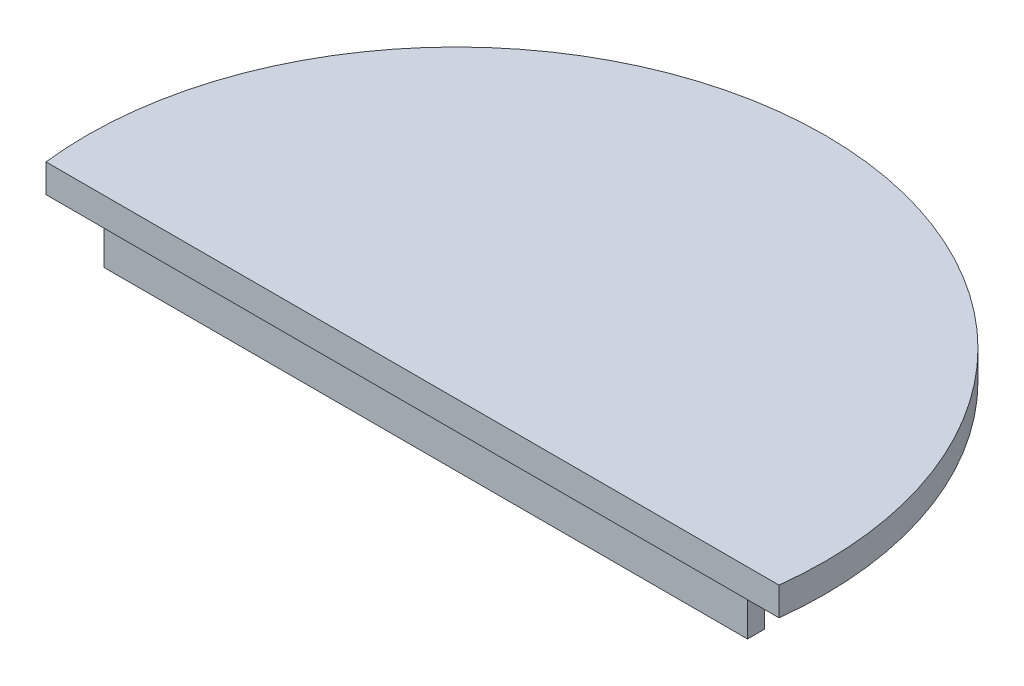
ISO-10303-21;
HEADER;
FILE_DESCRIPTION(('STEP AP214'),'2;1');
FILE_NAME('part.step','',(''),(''),'','','');
FILE_SCHEMA(('AUTOMOTIVE_DESIGN { 1 0 10303 214 1 1 1 1 }'));
ENDSEC;
DATA;
#1=APPLICATION_CONTEXT('core data for automotive mechanical design processes');
#2=APPLICATION_PROTOCOL_DEFINITION('international standard','automotive_design',2000,#1);
#3=PRODUCT_CONTEXT('',#1,'mechanical');
#4=PRODUCT('Part','Part','',(#3));
#5=PRODUCT_RELATED_PRODUCT_CATEGORY('part','',(#4));
#6=PRODUCT_DEFINITION_FORMATION('','',#4);
#7=PRODUCT_DEFINITION_CONTEXT('part definition',#1,'design');
#8=PRODUCT_DEFINITION('design','',#6,#7);
#9=PRODUCT_DEFINITION_SHAPE('','',#8);
#10=(LENGTH_UNIT() NAMED_UNIT(*) SI_UNIT(.MILLI.,.METRE.));
#11=(NAMED_UNIT(*) PLANE_ANGLE_UNIT() SI_UNIT($,.RADIAN.));
#12=(NAMED_UNIT(*) SI_UNIT($,.STERADIAN.) SOLID_ANGLE_UNIT());
#13=UNCERTAINTY_MEASURE_WITH_UNIT(LENGTH_MEASURE(1.E-05),#10,'distance_accuracy_value','');
#14=(GEOMETRIC_REPRESENTATION_CONTEXT(3) GLOBAL_UNCERTAINTY_ASSIGNED_CONTEXT((#13)) GLOBAL_UNIT_ASSIGNED_CONTEXT((#10,
#11,#12)) REPRESENTATION_CONTEXT('',''));
#15=CARTESIAN_POINT('',(0.,0.,0.));
#16=DIRECTION('',(0.,0.,1.));
#17=DIRECTION('',(1.,0.,0.));
#18=AXIS2_PLACEMENT_3D('',#15,#16,#17);
#19=CARTESIAN_POINT('',(0.,0.,0.));
#20=DIRECTION('',(0.,-1.,0.));
#21=DIRECTION('',(0.,0.,-1.));
#22=AXIS2_PLACEMENT_3D('',#19,#20,#21);
#23=PLANE('',#22);
#24=CARTESIAN_POINT('',(0.,0.,0.));
#25=DIRECTION('',(0.,-1.,0.));
#26=DIRECTION('',(0.,0.,-1.));
#27=AXIS2_PLACEMENT_3D('',#24,#25,#26);
#28=CIRCLE('',#27,39.);
#29=CARTESIAN_POINT('',(-38.7277678158708,0.,4.6));
#30=VERTEX_POINT('',#29);
#31=CARTESIAN_POINT('',(38.7277678158708,0.,4.6));
#32=VERTEX_POINT('',#31);
#33=EDGE_CURVE('E120',#30,#32,#28,.T.);
#34=ORIENTED_EDGE('',*,*,#33,.T.);
#35=DIRECTION('',(-1.,0.,0.));
#36=VECTOR('',#35,1.);
#37=CARTESIAN_POINT('',(0.,0.,4.6));
#38=LINE('',#37,#36);
#39=EDGE_CURVE('E11',#32,#30,#38,.T.);
#40=ORIENTED_EDGE('',*,*,#39,.T.);
#41=EDGE_LOOP('',(#34,#40));
#42=FACE_BOUND('',#41,.T.);
#43=DIRECTION('',(1.,0.,0.));
#44=VECTOR('',#43,1.);
#45=CARTESIAN_POINT('',(-34.,0.,1.4));
#46=LINE('',#45,#44);
#47=CARTESIAN_POINT('',(-34.,0.,1.4));
#48=VERTEX_POINT('',#47);
#49=CARTESIAN_POINT('',(34.,0.,1.4));
#50=VERTEX_POINT('',#49);
#51=EDGE_CURVE('E210',#48,#50,#46,.T.);
#52=ORIENTED_EDGE('',*,*,#51,.F.);
#53=DIRECTION('',(0.,0.,-1.));
#54=VECTOR('',#53,1.);
#55=CARTESIAN_POINT('',(-34.,0.,3.2));
#56=LINE('',#55,#54);
#57=CARTESIAN_POINT('',(-34.,0.,3.2));
#58=VERTEX_POINT('',#57);
#59=EDGE_CURVE('E107',#58,#48,#56,.T.);
#60=ORIENTED_EDGE('',*,*,#59,.F.);
#61=DIRECTION('',(-1.,0.,0.));
#62=VECTOR('',#61,1.);
#63=CARTESIAN_POINT('',(-34.,0.,3.2));
#64=LINE('',#63,#62);
#65=CARTESIAN_POINT('',(34.,0.,3.2));
#66=VERTEX_POINT('',#65);
#67=EDGE_CURVE('E103',#66,#58,#64,.T.);
#68=ORIENTED_EDGE('',*,*,#67,.F.);
#69=DIRECTION('',(0.,0.,1.));
#70=VECTOR('',#69,1.);
#71=CARTESIAN_POINT('',(34.,0.,3.2));
#72=LINE('',#71,#70);
#73=EDGE_CURVE('E207',#50,#66,#72,.T.);
#74=ORIENTED_EDGE('',*,*,#73,.F.);
#75=EDGE_LOOP('',(#52,#60,#68,#74));
#76=FACE_BOUND('',#75,.T.);
#77=ADVANCED_FACE('F32',(#42,#76),#23,.T.);
#78=CARTESIAN_POINT('',(0.,3.,0.));
#79=DIRECTION('',(0.,-1.,0.));
#80=DIRECTION('',(0.,0.,-1.));
#81=AXIS2_PLACEMENT_3D('',#78,#79,#80);
#82=CYLINDRICAL_SURFACE('',#81,39.);
#83=ORIENTED_EDGE('',*,*,#33,.F.);
#84=DIRECTION('',(0.,-1.,0.));
#85=VECTOR('',#84,1.);
#86=CARTESIAN_POINT('',(-38.7277678158708,3.,4.6));
#87=LINE('',#86,#85);
#88=CARTESIAN_POINT('',(-38.7277678158708,3.,4.6));
#89=VERTEX_POINT('',#88);
#90=EDGE_CURVE('E55',#30,#89,#87,.F.);
#91=ORIENTED_EDGE('',*,*,#90,.T.);
#92=CARTESIAN_POINT('',(0.,3.,0.));
#93=DIRECTION('',(0.,-1.,0.));
#94=DIRECTION('',(0.,0.,-1.));
#95=AXIS2_PLACEMENT_3D('',#92,#93,#94);
#96=CIRCLE('',#95,39.);
#97=CARTESIAN_POINT('',(38.7277678158708,3.,4.6));
#98=VERTEX_POINT('',#97);
#99=EDGE_CURVE('E40',#89,#98,#96,.T.);
#100=ORIENTED_EDGE('',*,*,#99,.T.);
#101=DIRECTION('',(0.,-1.,0.));
#102=VECTOR('',#101,1.);
#103=CARTESIAN_POINT('',(38.7277678158708,3.,4.6));
#104=LINE('',#103,#102);
#105=EDGE_CURVE('E112',#98,#32,#104,.T.);
#106=ORIENTED_EDGE('',*,*,#105,.T.);
#107=EDGE_LOOP('',(#83,#91,#100,#106));
#108=FACE_BOUND('',#107,.T.);
#109=ADVANCED_FACE('F34',(#108),#82,.T.);
#110=CARTESIAN_POINT('',(0.,3.,0.));
#111=DIRECTION('',(0.,-1.,0.));
#112=DIRECTION('',(0.,0.,-1.));
#113=AXIS2_PLACEMENT_3D('',#110,#111,#112);
#114=PLANE('',#113);
#115=DIRECTION('',(1.,0.,0.));
#116=VECTOR('',#115,1.);
#117=CARTESIAN_POINT('',(-54.8877610220587,3.,4.6));
#118=LINE('',#117,#116);
#119=EDGE_CURVE('E109',#89,#98,#118,.T.);
#120=ORIENTED_EDGE('',*,*,#119,.T.);
#121=ORIENTED_EDGE('',*,*,#99,.F.);
#122=EDGE_LOOP('',(#120,#121));
#123=FACE_BOUND('',#122,.T.);
#124=ADVANCED_FACE('F130',(#123),#114,.F.);
#125=CARTESIAN_POINT('',(-54.8877610220587,0.,4.6));
#126=DIRECTION('',(0.,0.,1.));
#127=DIRECTION('',(1.,0.,0.));
#128=AXIS2_PLACEMENT_3D('',#125,#126,#127);
#129=PLANE('',#128);
#130=ORIENTED_EDGE('',*,*,#39,.F.);
#131=ORIENTED_EDGE('',*,*,#105,.F.);
#132=ORIENTED_EDGE('',*,*,#119,.F.);
#133=ORIENTED_EDGE('',*,*,#90,.F.);
#134=EDGE_LOOP('',(#130,#131,#132,#133));
#135=FACE_BOUND('',#134,.T.);
#136=ADVANCED_FACE('F128',(#135),#129,.T.);
#137=CARTESIAN_POINT('',(-34.,-5.,3.2));
#138=DIRECTION('',(1.,0.,0.));
#139=DIRECTION('',(0.,0.,-1.));
#140=AXIS2_PLACEMENT_3D('',#137,#138,#139);
#141=PLANE('',#140);
#142=ORIENTED_EDGE('',*,*,#59,.T.);
#143=DIRECTION('',(0.,1.,0.));
#144=VECTOR('',#143,1.);
#145=CARTESIAN_POINT('',(-34.,-5.,1.4));
#146=LINE('',#145,#144);
#147=CARTESIAN_POINT('',(-34.,-5.,1.4));
#148=VERTEX_POINT('',#147);
#149=EDGE_CURVE('E88',#148,#48,#146,.T.);
#150=ORIENTED_EDGE('',*,*,#149,.F.);
#151=DIRECTION('',(0.,0.,-1.));
#152=VECTOR('',#151,1.);
#153=CARTESIAN_POINT('',(-34.,-5.,3.2));
#154=LINE('',#153,#152);
#155=CARTESIAN_POINT('',(-34.,-5.,3.2));
#156=VERTEX_POINT('',#155);
#157=EDGE_CURVE('E95',#156,#148,#154,.T.);
#158=ORIENTED_EDGE('',*,*,#157,.F.);
#159=DIRECTION('',(0.,1.,0.));
#160=VECTOR('',#159,1.);
#161=CARTESIAN_POINT('',(-34.,-5.,3.2));
#162=LINE('',#161,#160);
#163=EDGE_CURVE('E205',#156,#58,#162,.T.);
#164=ORIENTED_EDGE('',*,*,#163,.T.);
#165=EDGE_LOOP('',(#142,#150,#158,#164));
#166=FACE_BOUND('',#165,.T.);
#167=ADVANCED_FACE('F105',(#166),#141,.F.);
#168=CARTESIAN_POINT('',(-34.,-5.,1.4));
#169=DIRECTION('',(0.,0.,1.));
#170=DIRECTION('',(1.,0.,0.));
#171=AXIS2_PLACEMENT_3D('',#168,#169,#170);
#172=PLANE('',#171);
#173=ORIENTED_EDGE('',*,*,#51,.T.);
#174=DIRECTION('',(0.,1.,0.));
#175=VECTOR('',#174,1.);
#176=CARTESIAN_POINT('',(34.,-5.,1.4));
#177=LINE('',#176,#175);
#178=CARTESIAN_POINT('',(34.,-5.,1.4));
#179=VERTEX_POINT('',#178);
#180=EDGE_CURVE('E91',#179,#50,#177,.T.);
#181=ORIENTED_EDGE('',*,*,#180,.F.);
#182=DIRECTION('',(1.,0.,0.));
#183=VECTOR('',#182,1.);
#184=CARTESIAN_POINT('',(-34.,-5.,1.4));
#185=LINE('',#184,#183);
#186=EDGE_CURVE('E84',#148,#179,#185,.T.);
#187=ORIENTED_EDGE('',*,*,#186,.F.);
#188=ORIENTED_EDGE('',*,*,#149,.T.);
#189=EDGE_LOOP('',(#173,#181,#187,#188));
#190=FACE_BOUND('',#189,.T.);
#191=ADVANCED_FACE('F86',(#190),#172,.F.);
#192=CARTESIAN_POINT('',(34.,-5.,3.2));
#193=DIRECTION('',(-1.,0.,0.));
#194=DIRECTION('',(0.,0.,1.));
#195=AXIS2_PLACEMENT_3D('',#192,#193,#194);
#196=PLANE('',#195);
#197=ORIENTED_EDGE('',*,*,#73,.T.);
#198=DIRECTION('',(0.,1.,0.));
#199=VECTOR('',#198,1.);
#200=CARTESIAN_POINT('',(34.,-5.,3.2));
#201=LINE('',#200,#199);
#202=CARTESIAN_POINT('',(34.,-5.,3.2));
#203=VERTEX_POINT('',#202);
#204=EDGE_CURVE('E47',#203,#66,#201,.T.);
#205=ORIENTED_EDGE('',*,*,#204,.F.);
#206=DIRECTION('',(0.,0.,1.));
#207=VECTOR('',#206,1.);
#208=CARTESIAN_POINT('',(34.,-5.,3.2));
#209=LINE('',#208,#207);
#210=EDGE_CURVE('E94',#179,#203,#209,.T.);
#211=ORIENTED_EDGE('',*,*,#210,.F.);
#212=ORIENTED_EDGE('',*,*,#180,.T.);
#213=EDGE_LOOP('',(#197,#205,#211,#212));
#214=FACE_BOUND('',#213,.T.);
#215=ADVANCED_FACE('F169',(#214),#196,.F.);
#216=CARTESIAN_POINT('',(-34.,-5.,3.2));
#217=DIRECTION('',(0.,0.,-1.));
#218=DIRECTION('',(-1.,0.,0.));
#219=AXIS2_PLACEMENT_3D('',#216,#217,#218);
#220=PLANE('',#219);
#221=ORIENTED_EDGE('',*,*,#67,.T.);
#222=ORIENTED_EDGE('',*,*,#163,.F.);
#223=DIRECTION('',(-1.,0.,0.));
#224=VECTOR('',#223,1.);
#225=CARTESIAN_POINT('',(-34.,-5.,3.2));
#226=LINE('',#225,#224);
#227=EDGE_CURVE('E99',#203,#156,#226,.T.);
#228=ORIENTED_EDGE('',*,*,#227,.F.);
#229=ORIENTED_EDGE('',*,*,#204,.T.);
#230=EDGE_LOOP('',(#221,#222,#228,#229));
#231=FACE_BOUND('',#230,.T.);
#232=ADVANCED_FACE('F176',(#231),#220,.F.);
#233=CARTESIAN_POINT('',(0.,-5.,0.));
#234=DIRECTION('',(0.,-1.,0.));
#235=DIRECTION('',(0.,0.,-1.));
#236=AXIS2_PLACEMENT_3D('',#233,#234,#235);
#237=PLANE('',#236);
#238=ORIENTED_EDGE('',*,*,#157,.T.);
#239=ORIENTED_EDGE('',*,*,#186,.T.);
#240=ORIENTED_EDGE('',*,*,#210,.T.);
#241=ORIENTED_EDGE('',*,*,#227,.T.);
#242=EDGE_LOOP('',(#238,#239,#240,#241));
#243=FACE_BOUND('',#242,.T.);
#244=ADVANCED_FACE('F98',(#243),#237,.T.);
#245=CLOSED_SHELL('',(#77,#109,#124,#136,#167,#191,#215,#232,#244));
#246=MANIFOLD_SOLID_BREP('B2',#245);
#247=ADVANCED_BREP_SHAPE_REPRESENTATION('',(#18,#246),#14);
#248=SHAPE_DEFINITION_REPRESENTATION(#9,#247);
ENDSEC;
END-ISO-10303-21;
